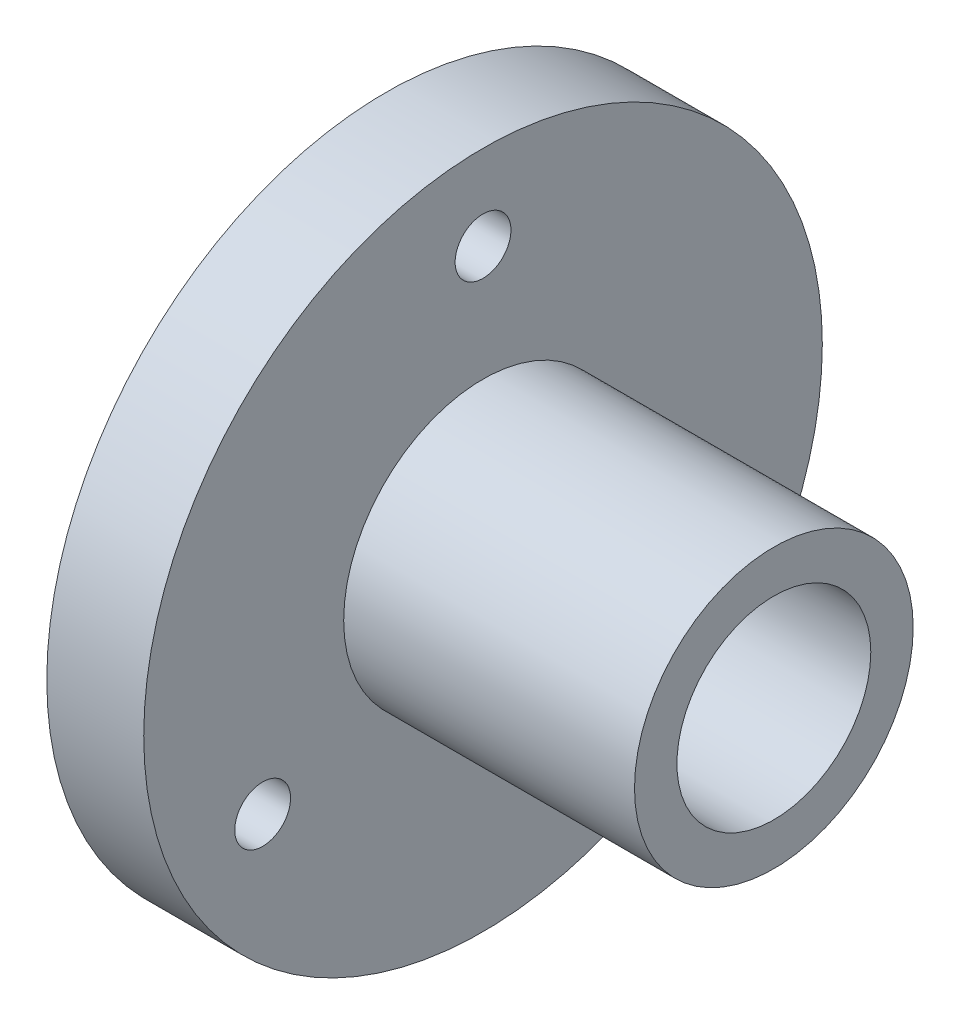
ISO-10303-21;
HEADER;
FILE_DESCRIPTION(('STEP AP214'),'2;1');
FILE_NAME('part.step','',(''),(''),'','','');
FILE_SCHEMA(('AUTOMOTIVE_DESIGN { 1 0 10303 214 1 1 1 1 }'));
ENDSEC;
DATA;
#1=APPLICATION_CONTEXT('core data for automotive mechanical design processes');
#2=APPLICATION_PROTOCOL_DEFINITION('international standard','automotive_design',2000,#1);
#3=PRODUCT_CONTEXT('',#1,'mechanical');
#4=PRODUCT('Part','Part','',(#3));
#5=PRODUCT_RELATED_PRODUCT_CATEGORY('part','',(#4));
#6=PRODUCT_DEFINITION_FORMATION('','',#4);
#7=PRODUCT_DEFINITION_CONTEXT('part definition',#1,'design');
#8=PRODUCT_DEFINITION('design','',#6,#7);
#9=PRODUCT_DEFINITION_SHAPE('','',#8);
#10=(LENGTH_UNIT() NAMED_UNIT(*) SI_UNIT(.MILLI.,.METRE.));
#11=(NAMED_UNIT(*) PLANE_ANGLE_UNIT() SI_UNIT($,.RADIAN.));
#12=(NAMED_UNIT(*) SI_UNIT($,.STERADIAN.) SOLID_ANGLE_UNIT());
#13=UNCERTAINTY_MEASURE_WITH_UNIT(LENGTH_MEASURE(1.E-05),#10,'distance_accuracy_value','');
#14=(GEOMETRIC_REPRESENTATION_CONTEXT(3) GLOBAL_UNCERTAINTY_ASSIGNED_CONTEXT((#13)) GLOBAL_UNIT_ASSIGNED_CONTEXT((#10,
#11,#12)) REPRESENTATION_CONTEXT('',''));
#15=CARTESIAN_POINT('',(0.,0.,0.));
#16=DIRECTION('',(0.,0.,1.));
#17=DIRECTION('',(1.,0.,0.));
#18=AXIS2_PLACEMENT_3D('',#15,#16,#17);
#19=CARTESIAN_POINT('',(4.,0.,0.));
#20=DIRECTION('',(1.,0.,0.));
#21=DIRECTION('',(0.,0.,-1.));
#22=AXIS2_PLACEMENT_3D('',#19,#20,#21);
#23=PLANE('',#22);
#24=CARTESIAN_POINT('',(4.,0.,0.));
#25=DIRECTION('',(1.,0.,0.));
#26=DIRECTION('',(0.,0.,-1.));
#27=AXIS2_PLACEMENT_3D('',#24,#25,#26);
#28=CIRCLE('',#27,5.75);
#29=CARTESIAN_POINT('',(4.,0.,-5.75));
#30=VERTEX_POINT('',#29);
#31=EDGE_CURVE('E61',#30,#30,#28,.T.);
#32=ORIENTED_EDGE('',*,*,#31,.F.);
#33=EDGE_LOOP('',(#32));
#34=FACE_BOUND('',#33,.T.);
#35=CARTESIAN_POINT('',(4.,-5.24999999999961,-9.09326673973728));
#36=DIRECTION('',(1.,0.,0.));
#37=DIRECTION('',(0.,0.,-1.));
#38=AXIS2_PLACEMENT_3D('',#35,#36,#37);
#39=CIRCLE('',#38,1.15135093902597);
#40=CARTESIAN_POINT('',(4.,-5.24999999999961,-10.2446176787632));
#41=VERTEX_POINT('',#40);
#42=EDGE_CURVE('E46',#41,#41,#39,.T.);
#43=ORIENTED_EDGE('',*,*,#42,.F.);
#44=EDGE_LOOP('',(#43));
#45=FACE_BOUND('',#44,.T.);
#46=CARTESIAN_POINT('',(4.,0.,0.));
#47=DIRECTION('',(1.,0.,0.));
#48=DIRECTION('',(0.,0.,-1.));
#49=AXIS2_PLACEMENT_3D('',#46,#47,#48);
#50=CIRCLE('',#49,14.);
#51=CARTESIAN_POINT('',(4.,0.,-14.));
#52=VERTEX_POINT('',#51);
#53=EDGE_CURVE('E10',#52,#52,#50,.T.);
#54=ORIENTED_EDGE('',*,*,#53,.T.);
#55=EDGE_LOOP('',(#54));
#56=FACE_BOUND('',#55,.T.);
#57=CARTESIAN_POINT('',(4.,10.5,0.));
#58=DIRECTION('',(1.,0.,0.));
#59=DIRECTION('',(0.,0.,-1.));
#60=AXIS2_PLACEMENT_3D('',#57,#58,#59);
#61=CIRCLE('',#60,1.15135093902538);
#62=CARTESIAN_POINT('',(4.,10.5,-1.15135093902538));
#63=VERTEX_POINT('',#62);
#64=EDGE_CURVE('E41',#63,#63,#61,.T.);
#65=ORIENTED_EDGE('',*,*,#64,.F.);
#66=EDGE_LOOP('',(#65));
#67=FACE_BOUND('',#66,.T.);
#68=CARTESIAN_POINT('',(4.,-5.25000000000039,9.09326673973594));
#69=DIRECTION('',(1.,0.,0.));
#70=DIRECTION('',(0.,0.,-1.));
#71=AXIS2_PLACEMENT_3D('',#68,#69,#70);
#72=CIRCLE('',#71,1.15135093902623);
#73=CARTESIAN_POINT('',(4.,-5.25000000000039,7.94191580070971));
#74=VERTEX_POINT('',#73);
#75=EDGE_CURVE('E52',#74,#74,#72,.T.);
#76=ORIENTED_EDGE('',*,*,#75,.F.);
#77=EDGE_LOOP('',(#76));
#78=FACE_BOUND('',#77,.T.);
#79=ADVANCED_FACE('F30',(#34,#45,#56,#67,#78),#23,.T.);
#80=CARTESIAN_POINT('',(0.,0.,0.));
#81=DIRECTION('',(1.,0.,0.));
#82=DIRECTION('',(0.,0.,-1.));
#83=AXIS2_PLACEMENT_3D('',#80,#81,#82);
#84=PLANE('',#83);
#85=CARTESIAN_POINT('',(0.,0.,0.));
#86=DIRECTION('',(1.,0.,0.));
#87=DIRECTION('',(0.,0.,-1.));
#88=AXIS2_PLACEMENT_3D('',#85,#86,#87);
#89=CIRCLE('',#88,4.);
#90=CARTESIAN_POINT('',(0.,0.,-4.));
#91=VERTEX_POINT('',#90);
#92=EDGE_CURVE('E64',#91,#91,#89,.T.);
#93=ORIENTED_EDGE('',*,*,#92,.T.);
#94=EDGE_LOOP('',(#93));
#95=FACE_BOUND('',#94,.T.);
#96=CARTESIAN_POINT('',(0.,0.,0.));
#97=DIRECTION('',(1.,0.,0.));
#98=DIRECTION('',(0.,0.,-1.));
#99=AXIS2_PLACEMENT_3D('',#96,#97,#98);
#100=CIRCLE('',#99,14.);
#101=CARTESIAN_POINT('',(0.,0.,-14.));
#102=VERTEX_POINT('',#101);
#103=EDGE_CURVE('E34',#102,#102,#100,.T.);
#104=ORIENTED_EDGE('',*,*,#103,.F.);
#105=EDGE_LOOP('',(#104));
#106=FACE_BOUND('',#105,.T.);
#107=CARTESIAN_POINT('',(0.,10.5,0.));
#108=DIRECTION('',(1.,0.,0.));
#109=DIRECTION('',(0.,0.,-1.));
#110=AXIS2_PLACEMENT_3D('',#107,#108,#109);
#111=CIRCLE('',#110,1.15135093902538);
#112=CARTESIAN_POINT('',(0.,10.5,-1.15135093902538));
#113=VERTEX_POINT('',#112);
#114=EDGE_CURVE('E43',#113,#113,#111,.T.);
#115=ORIENTED_EDGE('',*,*,#114,.T.);
#116=EDGE_LOOP('',(#115));
#117=FACE_BOUND('',#116,.T.);
#118=CARTESIAN_POINT('',(0.,-5.24999999999961,-9.09326673973728));
#119=DIRECTION('',(1.,0.,0.));
#120=DIRECTION('',(0.,0.,-1.));
#121=AXIS2_PLACEMENT_3D('',#118,#119,#120);
#122=CIRCLE('',#121,1.15135093902597);
#123=CARTESIAN_POINT('',(0.,-5.24999999999961,-10.2446176787632));
#124=VERTEX_POINT('',#123);
#125=EDGE_CURVE('E49',#124,#124,#122,.T.);
#126=ORIENTED_EDGE('',*,*,#125,.T.);
#127=EDGE_LOOP('',(#126));
#128=FACE_BOUND('',#127,.T.);
#129=CARTESIAN_POINT('',(0.,-5.25000000000039,9.09326673973594));
#130=DIRECTION('',(1.,0.,0.));
#131=DIRECTION('',(0.,0.,-1.));
#132=AXIS2_PLACEMENT_3D('',#129,#130,#131);
#133=CIRCLE('',#132,1.15135093902623);
#134=CARTESIAN_POINT('',(0.,-5.25000000000039,7.94191580070971));
#135=VERTEX_POINT('',#134);
#136=EDGE_CURVE('E55',#135,#135,#133,.T.);
#137=ORIENTED_EDGE('',*,*,#136,.T.);
#138=EDGE_LOOP('',(#137));
#139=FACE_BOUND('',#138,.T.);
#140=ADVANCED_FACE('F73',(#95,#106,#117,#128,#139),#84,.F.);
#141=CARTESIAN_POINT('',(4.,0.,0.));
#142=DIRECTION('',(-1.,0.,0.));
#143=DIRECTION('',(0.,0.,1.));
#144=AXIS2_PLACEMENT_3D('',#141,#142,#143);
#145=CYLINDRICAL_SURFACE('',#144,14.);
#146=ORIENTED_EDGE('',*,*,#53,.F.);
#147=EDGE_LOOP('',(#146));
#148=FACE_BOUND('',#147,.T.);
#149=ORIENTED_EDGE('',*,*,#103,.T.);
#150=EDGE_LOOP('',(#149));
#151=FACE_BOUND('',#150,.T.);
#152=ADVANCED_FACE('F32',(#148,#151),#145,.T.);
#153=CARTESIAN_POINT('',(4.,10.5,0.));
#154=DIRECTION('',(-1.,0.,0.));
#155=DIRECTION('',(0.,0.,1.));
#156=AXIS2_PLACEMENT_3D('',#153,#154,#155);
#157=CYLINDRICAL_SURFACE('',#156,1.15135093902538);
#158=ORIENTED_EDGE('',*,*,#64,.T.);
#159=EDGE_LOOP('',(#158));
#160=FACE_BOUND('',#159,.T.);
#161=ORIENTED_EDGE('',*,*,#114,.F.);
#162=EDGE_LOOP('',(#161));
#163=FACE_BOUND('',#162,.T.);
#164=ADVANCED_FACE('F114',(#160,#163),#157,.F.);
#165=CARTESIAN_POINT('',(4.,-5.24999999999961,-9.09326673973728));
#166=DIRECTION('',(-1.,0.,0.));
#167=DIRECTION('',(0.,0.,1.));
#168=AXIS2_PLACEMENT_3D('',#165,#166,#167);
#169=CYLINDRICAL_SURFACE('',#168,1.15135093902597);
#170=ORIENTED_EDGE('',*,*,#42,.T.);
#171=EDGE_LOOP('',(#170));
#172=FACE_BOUND('',#171,.T.);
#173=ORIENTED_EDGE('',*,*,#125,.F.);
#174=EDGE_LOOP('',(#173));
#175=FACE_BOUND('',#174,.T.);
#176=ADVANCED_FACE('F106',(#172,#175),#169,.F.);
#177=CARTESIAN_POINT('',(4.,-5.25000000000039,9.09326673973594));
#178=DIRECTION('',(-1.,0.,0.));
#179=DIRECTION('',(0.,0.,1.));
#180=AXIS2_PLACEMENT_3D('',#177,#178,#179);
#181=CYLINDRICAL_SURFACE('',#180,1.15135093902623);
#182=ORIENTED_EDGE('',*,*,#75,.T.);
#183=EDGE_LOOP('',(#182));
#184=FACE_BOUND('',#183,.T.);
#185=ORIENTED_EDGE('',*,*,#136,.F.);
#186=EDGE_LOOP('',(#185));
#187=FACE_BOUND('',#186,.T.);
#188=ADVANCED_FACE('F91',(#184,#187),#181,.F.);
#189=CARTESIAN_POINT('',(16.,0.,0.));
#190=DIRECTION('',(-1.,0.,0.));
#191=DIRECTION('',(0.,0.,1.));
#192=AXIS2_PLACEMENT_3D('',#189,#190,#191);
#193=CYLINDRICAL_SURFACE('',#192,5.75);
#194=CARTESIAN_POINT('',(16.,0.,0.));
#195=DIRECTION('',(1.,0.,0.));
#196=DIRECTION('',(0.,0.,-1.));
#197=AXIS2_PLACEMENT_3D('',#194,#195,#196);
#198=CIRCLE('',#197,5.75);
#199=CARTESIAN_POINT('',(16.,0.,-5.75));
#200=VERTEX_POINT('',#199);
#201=EDGE_CURVE('E58',#200,#200,#198,.T.);
#202=ORIENTED_EDGE('',*,*,#201,.F.);
#203=EDGE_LOOP('',(#202));
#204=FACE_BOUND('',#203,.T.);
#205=ORIENTED_EDGE('',*,*,#31,.T.);
#206=EDGE_LOOP('',(#205));
#207=FACE_BOUND('',#206,.T.);
#208=ADVANCED_FACE('F85',(#204,#207),#193,.T.);
#209=CARTESIAN_POINT('',(16.,0.,0.));
#210=DIRECTION('',(1.,0.,0.));
#211=DIRECTION('',(0.,0.,-1.));
#212=AXIS2_PLACEMENT_3D('',#209,#210,#211);
#213=PLANE('',#212);
#214=CARTESIAN_POINT('',(16.,0.,0.));
#215=DIRECTION('',(1.,0.,0.));
#216=DIRECTION('',(0.,0.,-1.));
#217=AXIS2_PLACEMENT_3D('',#214,#215,#216);
#218=CIRCLE('',#217,4.);
#219=CARTESIAN_POINT('',(16.,0.,-4.));
#220=VERTEX_POINT('',#219);
#221=EDGE_CURVE('E67',#220,#220,#218,.T.);
#222=ORIENTED_EDGE('',*,*,#221,.F.);
#223=EDGE_LOOP('',(#222));
#224=FACE_BOUND('',#223,.T.);
#225=ORIENTED_EDGE('',*,*,#201,.T.);
#226=EDGE_LOOP('',(#225));
#227=FACE_BOUND('',#226,.T.);
#228=ADVANCED_FACE('F79',(#224,#227),#213,.T.);
#229=CARTESIAN_POINT('',(0.,0.,0.));
#230=DIRECTION('',(1.,0.,0.));
#231=DIRECTION('',(0.,0.,-1.));
#232=AXIS2_PLACEMENT_3D('',#229,#230,#231);
#233=CYLINDRICAL_SURFACE('',#232,4.);
#234=ORIENTED_EDGE('',*,*,#92,.F.);
#235=EDGE_LOOP('',(#234));
#236=FACE_BOUND('',#235,.T.);
#237=ORIENTED_EDGE('',*,*,#221,.T.);
#238=EDGE_LOOP('',(#237));
#239=FACE_BOUND('',#238,.T.);
#240=ADVANCED_FACE('F76',(#236,#239),#233,.F.);
#241=CLOSED_SHELL('',(#79,#140,#152,#164,#176,#188,#208,#228,#240));
#242=MANIFOLD_SOLID_BREP('B2',#241);
#243=ADVANCED_BREP_SHAPE_REPRESENTATION('',(#18,#242),#14);
#244=SHAPE_DEFINITION_REPRESENTATION(#9,#243);
ENDSEC;
END-ISO-10303-21;
